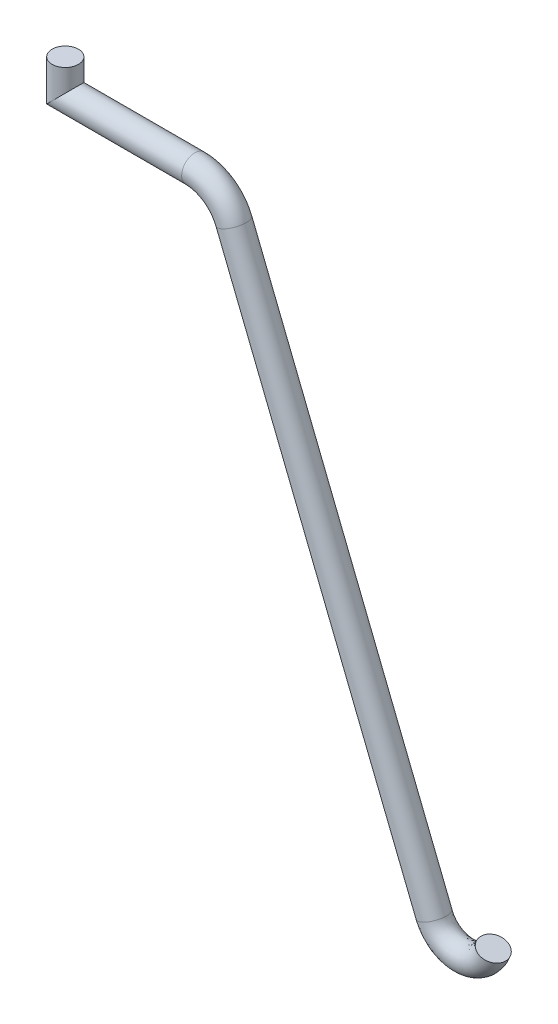
ISO-10303-21;
HEADER;
FILE_DESCRIPTION(('STEP AP214'),'2;1');
FILE_NAME('part.step','',(''),(''),'','','');
FILE_SCHEMA(('AUTOMOTIVE_DESIGN { 1 0 10303 214 1 1 1 1 }'));
ENDSEC;
DATA;
#1=APPLICATION_CONTEXT('core data for automotive mechanical design processes');
#2=APPLICATION_PROTOCOL_DEFINITION('international standard','automotive_design',2000,#1);
#3=PRODUCT_CONTEXT('',#1,'mechanical');
#4=PRODUCT('Part','Part','',(#3));
#5=PRODUCT_RELATED_PRODUCT_CATEGORY('part','',(#4));
#6=PRODUCT_DEFINITION_FORMATION('','',#4);
#7=PRODUCT_DEFINITION_CONTEXT('part definition',#1,'design');
#8=PRODUCT_DEFINITION('design','',#6,#7);
#9=PRODUCT_DEFINITION_SHAPE('','',#8);
#10=(LENGTH_UNIT() NAMED_UNIT(*) SI_UNIT(.MILLI.,.METRE.));
#11=(NAMED_UNIT(*) PLANE_ANGLE_UNIT() SI_UNIT($,.RADIAN.));
#12=(NAMED_UNIT(*) SI_UNIT($,.STERADIAN.) SOLID_ANGLE_UNIT());
#13=UNCERTAINTY_MEASURE_WITH_UNIT(LENGTH_MEASURE(1.E-05),#10,'distance_accuracy_value','');
#14=(GEOMETRIC_REPRESENTATION_CONTEXT(3) GLOBAL_UNCERTAINTY_ASSIGNED_CONTEXT((#13)) GLOBAL_UNIT_ASSIGNED_CONTEXT((#10,
#11,#12)) REPRESENTATION_CONTEXT('',''));
#15=CARTESIAN_POINT('',(0.,0.,0.));
#16=DIRECTION('',(0.,0.,1.));
#17=DIRECTION('',(1.,0.,0.));
#18=AXIS2_PLACEMENT_3D('',#15,#16,#17);
#19=CARTESIAN_POINT('',(16.0057749178334,-2.5144372945836,0.));
#20=DIRECTION('',(0.371390676354104,-0.928476690885259,0.));
#21=DIRECTION('',(0.928476690885259,0.371390676354104,0.));
#22=AXIS2_PLACEMENT_3D('',#19,#20,#21);
#23=CYLINDRICAL_SURFACE('',#22,1.25);
#24=CARTESIAN_POINT('',(16.0057749178334,-2.5144372945836,0.));
#25=DIRECTION('',(0.371390676354099,-0.928476690885261,0.));
#26=DIRECTION('',(0.928476690885261,0.371390676354099,0.));
#27=AXIS2_PLACEMENT_3D('',#24,#25,#26);
#28=CIRCLE('',#27,1.25);
#29=CARTESIAN_POINT('',(17.16637078144,-2.05019894914098,0.));
#30=VERTEX_POINT('',#29);
#31=EDGE_CURVE('E12',#30,#30,#28,.T.);
#32=ORIENTED_EDGE('',*,*,#31,.T.);
#33=EDGE_LOOP('',(#32));
#34=FACE_BOUND('',#33,.T.);
#35=CARTESIAN_POINT('',(36.1656413365394,-49.5483753368895,0.));
#36=CARTESIAN_POINT('',(36.1656413365394,-49.5483753368895,-2.5));
#37=CARTESIAN_POINT('',(33.8343586634606,-50.4516246631105,-2.5));
#38=CARTESIAN_POINT('',(33.8343586634606,-50.4516246631105,0.));
#39=CARTESIAN_POINT('',(33.8343586634606,-50.4516246631105,2.5));
#40=CARTESIAN_POINT('',(36.1656413365394,-49.5483753368895,2.5));
#41=CARTESIAN_POINT('',(36.1656413365394,-49.5483753368895,0.));
#42=(BOUNDED_CURVE() B_SPLINE_CURVE(3,(#35,#36,#37,#38,#39,#40,#41),.UNSPECIFIED.,.T.,
.F.) B_SPLINE_CURVE_WITH_KNOTS((4,3,4),(0.,0.5,1.),
.UNSPECIFIED.) CURVE() GEOMETRIC_REPRESENTATION_ITEM() RATIONAL_B_SPLINE_CURVE((1.,
0.333333333333333,0.333333333333333,1.,0.333333333333333,0.333333333333333,1.)) REPRESENTATION_ITEM(''));
#43=CARTESIAN_POINT('',(36.1656413365394,-49.5483753368895,0.));
#44=VERTEX_POINT('',#43);
#45=EDGE_CURVE('E63',#44,#44,#42,.T.);
#46=ORIENTED_EDGE('',*,*,#45,.T.);
#47=EDGE_LOOP('',(#46));
#48=FACE_BOUND('',#47,.T.);
#49=ADVANCED_FACE('F41',(#34,#48),#23,.T.);
#50=CARTESIAN_POINT('',(12.2918681542924,-4.,0.));
#51=DIRECTION('',(0.,0.,-1.));
#52=DIRECTION('',(-1.,0.,0.));
#53=AXIS2_PLACEMENT_3D('',#50,#51,#52);
#54=TOROIDAL_SURFACE('',#53,4.,1.25);
#55=CARTESIAN_POINT('',(12.2918681542924,0.,0.));
#56=DIRECTION('',(1.,0.,0.));
#57=DIRECTION('',(0.,1.,0.));
#58=AXIS2_PLACEMENT_3D('',#55,#56,#57);
#59=CIRCLE('',#58,1.25);
#60=CARTESIAN_POINT('',(12.2918681542924,1.25,0.));
#61=VERTEX_POINT('',#60);
#62=EDGE_CURVE('E47',#61,#61,#59,.T.);
#63=CARTESIAN_POINT('',(12.2918681542924,-4.,0.));
#64=DIRECTION('',(0.,0.,-1.));
#65=DIRECTION('',(-1.,0.,0.));
#66=AXIS2_PLACEMENT_3D('',#63,#64,#65);
#67=CIRCLE('',#66,5.25);
#68=EDGE_CURVE('',#61,#30,#67,.T.);
#69=ORIENTED_EDGE('',*,*,#62,.T.);
#70=ORIENTED_EDGE('',*,*,#31,.F.);
#71=ORIENTED_EDGE('',*,*,#68,.T.);
#72=ORIENTED_EDGE('',*,*,#68,.F.);
#73=EDGE_LOOP('',(#69,#71,#70,#72));
#74=FACE_BOUND('',#73,.T.);
#75=ADVANCED_FACE('F91',(#74),#54,.T.);
#76=CARTESIAN_POINT('',(0.,0.,0.));
#77=DIRECTION('',(1.,0.,0.));
#78=DIRECTION('',(0.,1.,0.));
#79=AXIS2_PLACEMENT_3D('',#76,#77,#78);
#80=CYLINDRICAL_SURFACE('',#79,1.25);
#81=CARTESIAN_POINT('',(0.,0.,0.));
#82=DIRECTION('',(0.707106781186548,-0.707106781186548,0.));
#83=DIRECTION('',(0.707106781186548,0.707106781186548,0.));
#84=AXIS2_PLACEMENT_3D('',#81,#82,#83);
#85=ELLIPSE('',#84,1.76776695296637,1.25);
#86=CARTESIAN_POINT('',(1.25,1.25,0.));
#87=VERTEX_POINT('',#86);
#88=EDGE_CURVE('E51',#87,#87,#85,.F.);
#89=ORIENTED_EDGE('',*,*,#88,.F.);
#90=EDGE_LOOP('',(#89));
#91=FACE_BOUND('',#90,.T.);
#92=ORIENTED_EDGE('',*,*,#62,.F.);
#93=EDGE_LOOP('',(#92));
#94=FACE_BOUND('',#93,.T.);
#95=ADVANCED_FACE('F95',(#91,#94),#80,.T.);
#96=CARTESIAN_POINT('',(0.,3.,0.));
#97=DIRECTION('',(0.,1.,0.));
#98=DIRECTION('',(0.,0.,1.));
#99=AXIS2_PLACEMENT_3D('',#96,#97,#98);
#100=PLANE('',#99);
#101=CARTESIAN_POINT('',(0.,3.,0.));
#102=DIRECTION('',(0.,1.,0.));
#103=DIRECTION('',(0.,0.,1.));
#104=AXIS2_PLACEMENT_3D('',#101,#102,#103);
#105=CIRCLE('',#104,1.25);
#106=CARTESIAN_POINT('',(0.,3.,1.25));
#107=VERTEX_POINT('',#106);
#108=EDGE_CURVE('E55',#107,#107,#105,.T.);
#109=ORIENTED_EDGE('',*,*,#108,.T.);
#110=EDGE_LOOP('',(#109));
#111=FACE_BOUND('',#110,.T.);
#112=ADVANCED_FACE('F86',(#111),#100,.T.);
#113=CARTESIAN_POINT('',(0.,-3.53553390593274,0.));
#114=DIRECTION('',(0.,1.,0.));
#115=DIRECTION('',(0.,0.,1.));
#116=AXIS2_PLACEMENT_3D('',#113,#114,#115);
#117=CYLINDRICAL_SURFACE('',#116,1.25);
#118=ORIENTED_EDGE('',*,*,#108,.F.);
#119=EDGE_LOOP('',(#118));
#120=FACE_BOUND('',#119,.T.);
#121=ORIENTED_EDGE('',*,*,#88,.T.);
#122=EDGE_LOOP('',(#121));
#123=FACE_BOUND('',#122,.T.);
#124=ADVANCED_FACE('F81',(#120,#123),#117,.T.);
#125=CARTESIAN_POINT('',(41.7883865373754,-50.4389043019856,0.));
#126=DIRECTION('',(0.351123441588487,0.936329177569009,0.));
#127=DIRECTION('',(-0.936329177569009,0.351123441588487,0.));
#128=AXIS2_PLACEMENT_3D('',#125,#126,#127);
#129=PLANE('',#128);
#130=CARTESIAN_POINT('',(40.6179750654141,-50.,0.));
#131=DIRECTION('',(0.35112344158849,0.936329177569008,0.));
#132=DIRECTION('',(-0.936329177569008,0.35112344158849,0.));
#133=AXIS2_PLACEMENT_3D('',#130,#131,#132);
#134=CIRCLE('',#133,1.25);
#135=CARTESIAN_POINT('',(39.4475635934529,-49.5610956980144,0.));
#136=VERTEX_POINT('',#135);
#137=EDGE_CURVE('E60',#136,#136,#134,.T.);
#138=ORIENTED_EDGE('',*,*,#137,.T.);
#139=EDGE_LOOP('',(#138));
#140=FACE_BOUND('',#139,.T.);
#141=ADVANCED_FACE('F76',(#140),#129,.T.);
#142=CARTESIAN_POINT('',(36.1656413365394,-49.5483753368895,0.));
#143=CARTESIAN_POINT('',(36.2236223115733,-49.7029912703131,0.));
#144=CARTESIAN_POINT('',(36.271975136826,-49.7901779662835,0.));
#145=CARTESIAN_POINT('',(36.4726271134132,-50.0981713321098,0.));
#146=CARTESIAN_POINT('',(36.7180769854262,-50.3291352974501,0.));
#147=CARTESIAN_POINT('',(37.0249007968097,-50.5234855437555,0.));
#148=CARTESIAN_POINT('',(37.4146819034184,-50.6635718862216,0.));
#149=CARTESIAN_POINT('',(37.8021222897834,-50.7124994707353,0.));
#150=CARTESIAN_POINT('',(38.1899893964931,-50.6668039599534,0.));
#151=CARTESIAN_POINT('',(38.5806946815393,-50.5293074113891,0.));
#152=CARTESIAN_POINT('',(38.8890810186834,-50.3375632393045,0.));
#153=CARTESIAN_POINT('',(39.1365531558425,-50.1085745187459,0.));
#154=CARTESIAN_POINT('',(39.3387269768365,-49.8018183371704,0.));
#155=CARTESIAN_POINT('',(39.3895831946737,-49.7157100947589,0.));
#156=CARTESIAN_POINT('',(39.4475635934529,-49.5610956980144,0.));
#157=CARTESIAN_POINT('',(36.1656413365394,-49.5483753368895,-2.5));
#158=CARTESIAN_POINT('',(36.2959670260972,-49.8959105090434,-2.5));
#159=CARTESIAN_POINT('',(36.2349928852501,-49.6915582495938,-2.5));
#160=CARTESIAN_POINT('',(36.4838917525014,-50.1282118948408,-2.5));
#161=CARTESIAN_POINT('',(36.7146888701384,-50.3200939303506,-2.5));
#162=CARTESIAN_POINT('',(37.0258876655324,-50.5261436369469,-2.5));
#163=CARTESIAN_POINT('',(37.4144242565375,-50.6627797225344,-2.5));
#164=CARTESIAN_POINT('',(37.8021222878998,-50.7128993058435,-2.5));
#165=CARTESIAN_POINT('',(38.1902470460825,-50.6660117918943,-2.5));
#166=CARTESIAN_POINT('',(38.5797077961559,-50.5319655485607,-2.5));
#167=CARTESIAN_POINT('',(38.8924692002725,-50.3285216955722,-2.5));
#168=CARTESIAN_POINT('',(39.125288455622,-50.1386152444436,-2.5));
#169=CARTESIAN_POINT('',(39.3757093411684,-49.7031983198117,-2.5));
#170=CARTESIAN_POINT('',(39.3172382403278,-49.9086299730145,-2.5));
#171=CARTESIAN_POINT('',(39.4475635934529,-49.5610956980144,-2.5));
#172=CARTESIAN_POINT('',(33.8343586634606,-50.4516246631105,-2.5));
#173=CARTESIAN_POINT('',(33.9646843530183,-50.7991598352644,-2.5));
#174=CARTESIAN_POINT('',(34.1063357963629,-51.0506722871327,-2.5));
#175=CARTESIAN_POINT('',(34.5841662099111,-51.7639800881706,-2.5));
#176=CARTESIAN_POINT('',(35.1802799639132,-52.3227414578067,-2.5));
#177=CARTESIAN_POINT('',(35.9708523423809,-52.8121970765945,-2.5));
#178=CARTESIAN_POINT('',(36.8351722678868,-53.1149123732616,-2.5));
#179=CARTESIAN_POINT('',(37.8158451247964,-53.2386910832845,-2.5));
#180=CARTESIAN_POINT('',(38.796111630127,-53.1116802419089,-2.5));
#181=CARTESIAN_POINT('',(39.6595072628862,-52.8063719222335,-2.5));
#182=CARTESIAN_POINT('',(40.4485049504771,-52.3143189614719,-2.5));
#183=CARTESIAN_POINT('',(41.0426035170256,-51.7535774213974,-2.5));
#184=CARTESIAN_POINT('',(41.5189117105591,-51.0390331029499,-2.5));
#185=CARTESIAN_POINT('',(41.6580611842503,-50.7864385769857,-2.5));
#186=CARTESIAN_POINT('',(41.7883865373754,-50.4389043019856,-2.5));
#187=CARTESIAN_POINT('',(33.8343586634606,-50.4516246631105,0.));
#188=CARTESIAN_POINT('',(33.9285119957564,-50.7027002158993,0.));
#189=CARTESIAN_POINT('',(34.1248269221509,-51.0999821454776,0.));
#190=CARTESIAN_POINT('',(34.578533890367,-51.748959806805,0.));
#191=CARTESIAN_POINT('',(35.181974021557,-52.3272621413565,0.));
#192=CARTESIAN_POINT('',(35.9703589080196,-52.8108680299988,0.));
#193=CARTESIAN_POINT('',(36.8353010913272,-53.1153084551052,0.));
#194=CARTESIAN_POINT('',(37.8158451257382,-53.2384911657304,0.));
#195=CARTESIAN_POINT('',(38.7959828053324,-53.1120763259384,0.));
#196=CARTESIAN_POINT('',(39.6600007055779,-52.8050428536477,0.));
#197=CARTESIAN_POINT('',(40.4468108596825,-52.3188397333381,0.));
#198=CARTESIAN_POINT('',(41.048235867136,-51.7385570585485,0.));
#199=CARTESIAN_POINT('',(41.5004205283931,-51.0883431116293,0.));
#200=CARTESIAN_POINT('',(41.6942336614233,-50.6899786378579,0.));
#201=CARTESIAN_POINT('',(41.7883865373754,-50.4389043019856,0.));
#202=CARTESIAN_POINT('',(33.8343586634606,-50.4516246631105,2.5));
#203=CARTESIAN_POINT('',(33.8923396384945,-50.6062405965341,2.5));
#204=CARTESIAN_POINT('',(34.1433180479388,-51.1492920038224,2.5));
#205=CARTESIAN_POINT('',(34.5729015708229,-51.7339395254395,2.5));
#206=CARTESIAN_POINT('',(35.1836680792009,-52.3317828249062,2.5));
#207=CARTESIAN_POINT('',(35.9698654736582,-52.8095389834032,2.5));
#208=CARTESIAN_POINT('',(36.8354299147676,-53.1157045369488,2.5));
#209=CARTESIAN_POINT('',(37.81584512668,-53.2382912481763,2.5));
#210=CARTESIAN_POINT('',(38.7958539805377,-53.1124724099679,2.5));
#211=CARTESIAN_POINT('',(39.6604941482696,-52.8037137850619,2.5));
#212=CARTESIAN_POINT('',(40.4451167688879,-52.3233605052042,2.5));
#213=CARTESIAN_POINT('',(41.0538682172463,-51.7235366956996,2.5));
#214=CARTESIAN_POINT('',(41.4819293462272,-51.1376531203087,2.5));
#215=CARTESIAN_POINT('',(41.7304061385962,-50.5935186987301,2.5));
#216=CARTESIAN_POINT('',(41.7883865373754,-50.4389043019856,2.5));
#217=CARTESIAN_POINT('',(36.1656413365394,-49.5483753368895,2.5));
#218=CARTESIAN_POINT('',(36.1512775970495,-49.5100720315829,2.5));
#219=CARTESIAN_POINT('',(36.3089573884019,-49.8887976829731,2.5));
#220=CARTESIAN_POINT('',(36.461362474325,-50.0681307693788,2.5));
#221=CARTESIAN_POINT('',(36.7214651007139,-50.3381766645496,2.5));
#222=CARTESIAN_POINT('',(37.023913928087,-50.5208274505642,2.5));
#223=CARTESIAN_POINT('',(37.4149395502992,-50.6643640499088,2.5));
#224=CARTESIAN_POINT('',(37.8021222916669,-50.7120996356271,2.5));
#225=CARTESIAN_POINT('',(38.1897317469038,-50.6675961280125,2.5));
#226=CARTESIAN_POINT('',(38.5816815669226,-50.5266492742175,2.5));
#227=CARTESIAN_POINT('',(38.8856928370942,-50.3466047830368,2.5));
#228=CARTESIAN_POINT('',(39.1478178560631,-50.0785337930482,2.5));
#229=CARTESIAN_POINT('',(39.3017446125046,-49.9004383545292,2.5));
#230=CARTESIAN_POINT('',(39.4619281490195,-49.5227902165033,2.5));
#231=CARTESIAN_POINT('',(39.4475635934529,-49.5610956980144,2.5));
#232=CARTESIAN_POINT('',(36.1656413365394,-49.5483753368895,0.));
#233=CARTESIAN_POINT('',(36.2236223115733,-49.7029912703131,0.));
#234=CARTESIAN_POINT('',(36.271975136826,-49.7901779662835,0.));
#235=CARTESIAN_POINT('',(36.4726271134132,-50.0981713321098,0.));
#236=CARTESIAN_POINT('',(36.7180769854262,-50.3291352974501,0.));
#237=CARTESIAN_POINT('',(37.0249007968097,-50.5234855437555,0.));
#238=CARTESIAN_POINT('',(37.4146819034184,-50.6635718862216,0.));
#239=CARTESIAN_POINT('',(37.8021222897834,-50.7124994707353,0.));
#240=CARTESIAN_POINT('',(38.1899893964931,-50.6668039599534,0.));
#241=CARTESIAN_POINT('',(38.5806946815393,-50.5293074113891,0.));
#242=CARTESIAN_POINT('',(38.8890810186834,-50.3375632393045,0.));
#243=CARTESIAN_POINT('',(39.1365531558425,-50.1085745187459,0.));
#244=CARTESIAN_POINT('',(39.3387269768365,-49.8018183371704,0.));
#245=CARTESIAN_POINT('',(39.3895831946737,-49.7157100947589,0.));
#246=CARTESIAN_POINT('',(39.4475635934529,-49.5610956980144,0.));
#247=(BOUNDED_SURFACE() B_SPLINE_SURFACE(3,3,((#142,#143,#144,#145,#146,#147,#148,#149,#150,
#151,#152,#153,#154,#155,#156),(#157,#158,#159,#160,#161,#162,#163,#164,#165,#166,#167,#168,
#169,#170,#171),(#172,#173,#174,#175,#176,#177,#178,#179,#180,#181,#182,#183,#184,#185,#186),
(#187,#188,#189,#190,#191,#192,#193,#194,#195,#196,#197,#198,#199,#200,#201),(#202,#203,#204,
#205,#206,#207,#208,#209,#210,#211,#212,#213,#214,#215,#216),(#217,#218,#219,#220,#221,#222,
#223,#224,#225,#226,#227,#228,#229,#230,#231),(#232,#233,#234,#235,#236,#237,#238,#239,#240,
#241,#242,#243,#244,#245,#246)),.UNSPECIFIED.,.T.,.F.,.F.) B_SPLINE_SURFACE_WITH_KNOTS((4,3,4),
(4,1,1,1,1,1,1,1,1,1,1,1,4),(0.,0.5,1.),(0.,0.0682617186838056,0.143393184731462,
0.224972222608674,0.312935827777693,0.405582521292551,0.500001556988992,0.594419778432468,
0.687066132048898,0.775030019100745,0.856608371004558,0.931739016898159,1.),
.UNSPECIFIED.) GEOMETRIC_REPRESENTATION_ITEM() RATIONAL_B_SPLINE_SURFACE(((1.,1.,1.,1.,1.,1.,1.,
1.,1.,1.,1.,1.,1.,1.,1.),(0.333333333333333,0.333333333333333,0.333333333333333,
0.333333333333333,0.333333333333333,0.333333333333333,0.333333333333333,0.333333333333333,
0.333333333333333,0.333333333333333,0.333333333333333,0.333333333333333,0.333333333333333,
0.333333333333333,0.333333333333333),(0.333333333333333,0.333333333333333,0.333333333333333,
0.333333333333333,0.333333333333333,0.333333333333333,0.333333333333333,0.333333333333333,
0.333333333333333,0.333333333333333,0.333333333333333,0.333333333333333,0.333333333333333,
0.333333333333333,0.333333333333333),(1.,1.,1.,1.,1.,1.,1.,1.,1.,1.,1.,1.,1.,1.,1.),
(0.333333333333333,0.333333333333333,0.333333333333333,0.333333333333333,0.333333333333333,
0.333333333333333,0.333333333333333,0.333333333333333,0.333333333333333,0.333333333333333,
0.333333333333333,0.333333333333333,0.333333333333333,0.333333333333333,0.333333333333333),
(0.333333333333333,0.333333333333333,0.333333333333333,0.333333333333333,0.333333333333333,
0.333333333333333,0.333333333333333,0.333333333333333,0.333333333333333,0.333333333333333,
0.333333333333333,0.333333333333333,0.333333333333333,0.333333333333333,0.333333333333333),(1.,
1.,1.,1.,1.,1.,1.,1.,1.,1.,1.,1.,1.,1.,1.))) REPRESENTATION_ITEM('') SURFACE());
#248=ORIENTED_EDGE('',*,*,#45,.F.);
#249=EDGE_LOOP('',(#248));
#250=FACE_BOUND('',#249,.T.);
#251=ORIENTED_EDGE('',*,*,#137,.F.);
#252=EDGE_LOOP('',(#251));
#253=FACE_BOUND('',#252,.T.);
#254=ADVANCED_FACE('F73',(#250,#253),#247,.F.);
#255=CLOSED_SHELL('',(#49,#75,#95,#112,#124,#141,#254));
#256=MANIFOLD_SOLID_BREP('B2',#255);
#257=ADVANCED_BREP_SHAPE_REPRESENTATION('',(#18,#256),#14);
#258=SHAPE_DEFINITION_REPRESENTATION(#9,#257);
ENDSEC;
END-ISO-10303-21;
